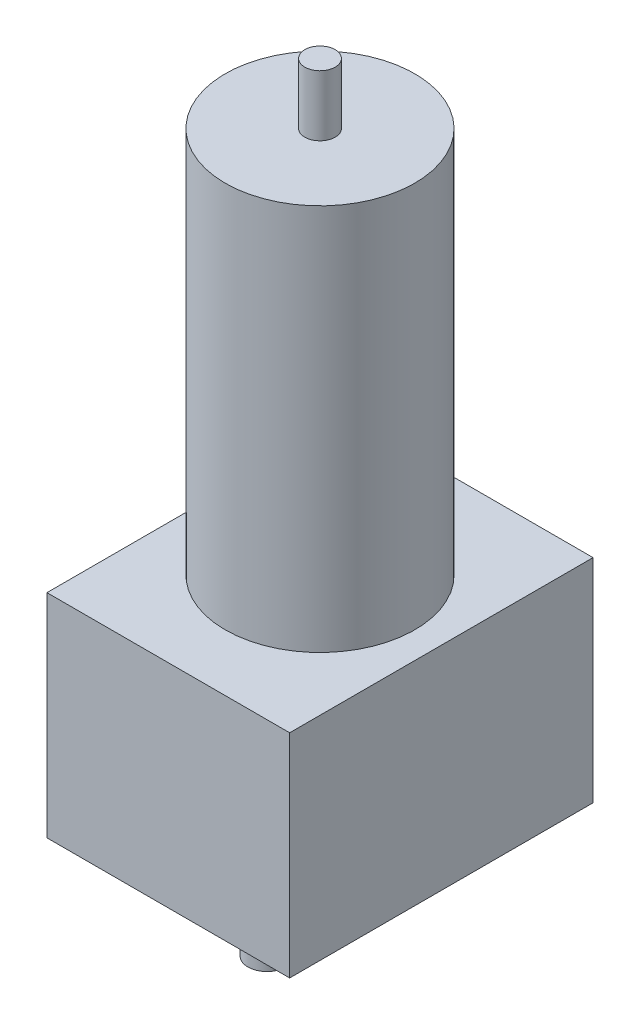
ISO-10303-21;
HEADER;
FILE_DESCRIPTION(('STEP AP214'),'2;1');
FILE_NAME('part.step','',(''),(''),'','','');
FILE_SCHEMA(('AUTOMOTIVE_DESIGN { 1 0 10303 214 1 1 1 1 }'));
ENDSEC;
DATA;
#1=APPLICATION_CONTEXT('core data for automotive mechanical design processes');
#2=APPLICATION_PROTOCOL_DEFINITION('international standard','automotive_design',2000,#1);
#3=PRODUCT_CONTEXT('',#1,'mechanical');
#4=PRODUCT('Part','Part','',(#3));
#5=PRODUCT_RELATED_PRODUCT_CATEGORY('part','',(#4));
#6=PRODUCT_DEFINITION_FORMATION('','',#4);
#7=PRODUCT_DEFINITION_CONTEXT('part definition',#1,'design');
#8=PRODUCT_DEFINITION('design','',#6,#7);
#9=PRODUCT_DEFINITION_SHAPE('','',#8);
#10=(LENGTH_UNIT() NAMED_UNIT(*) SI_UNIT(.MILLI.,.METRE.));
#11=(NAMED_UNIT(*) PLANE_ANGLE_UNIT() SI_UNIT($,.RADIAN.));
#12=(NAMED_UNIT(*) SI_UNIT($,.STERADIAN.) SOLID_ANGLE_UNIT());
#13=UNCERTAINTY_MEASURE_WITH_UNIT(LENGTH_MEASURE(1.E-05),#10,'distance_accuracy_value','');
#14=(GEOMETRIC_REPRESENTATION_CONTEXT(3) GLOBAL_UNCERTAINTY_ASSIGNED_CONTEXT((#13)) GLOBAL_UNIT_ASSIGNED_CONTEXT((#10,
#11,#12)) REPRESENTATION_CONTEXT('',''));
#15=CARTESIAN_POINT('',(0.,0.,0.));
#16=DIRECTION('',(0.,0.,1.));
#17=DIRECTION('',(1.,0.,0.));
#18=AXIS2_PLACEMENT_3D('',#15,#16,#17);
#19=CARTESIAN_POINT('',(0.,0.,0.));
#20=DIRECTION('',(0.,1.,0.));
#21=DIRECTION('',(0.,0.,1.));
#22=AXIS2_PLACEMENT_3D('',#19,#20,#21);
#23=PLANE('',#22);
#24=CARTESIAN_POINT('',(42.8625,0.,-50.1740619184623));
#25=DIRECTION('',(0.,-1.,0.));
#26=DIRECTION('',(0.,0.,-1.));
#27=AXIS2_PLACEMENT_3D('',#24,#25,#26);
#28=CIRCLE('',#27,3.96875);
#29=CARTESIAN_POINT('',(42.8625,0.,-54.1428119184623));
#30=VERTEX_POINT('',#29);
#31=EDGE_CURVE('E266',#30,#30,#28,.T.);
#32=ORIENTED_EDGE('',*,*,#31,.F.);
#33=EDGE_LOOP('',(#32));
#34=FACE_BOUND('',#33,.T.);
#35=CARTESIAN_POINT('',(-42.8625,0.,-50.1740619184623));
#36=DIRECTION('',(0.,-1.,0.));
#37=DIRECTION('',(0.,0.,-1.));
#38=AXIS2_PLACEMENT_3D('',#35,#36,#37);
#39=CIRCLE('',#38,3.96875);
#40=CARTESIAN_POINT('',(-42.8625,0.,-54.1428119184623));
#41=VERTEX_POINT('',#40);
#42=EDGE_CURVE('E265',#41,#41,#39,.T.);
#43=ORIENTED_EDGE('',*,*,#42,.F.);
#44=EDGE_LOOP('',(#43));
#45=FACE_BOUND('',#44,.T.);
#46=CARTESIAN_POINT('',(42.8625,0.,38.1));
#47=DIRECTION('',(0.,-1.,0.));
#48=DIRECTION('',(0.,0.,-1.));
#49=AXIS2_PLACEMENT_3D('',#46,#47,#48);
#50=CIRCLE('',#49,3.96875);
#51=CARTESIAN_POINT('',(42.8625,0.,34.13125));
#52=VERTEX_POINT('',#51);
#53=EDGE_CURVE('E275',#52,#52,#50,.T.);
#54=ORIENTED_EDGE('',*,*,#53,.F.);
#55=EDGE_LOOP('',(#54));
#56=FACE_BOUND('',#55,.T.);
#57=CARTESIAN_POINT('',(-42.8625,0.,38.1));
#58=DIRECTION('',(0.,-1.,0.));
#59=DIRECTION('',(0.,0.,-1.));
#60=AXIS2_PLACEMENT_3D('',#57,#58,#59);
#61=CIRCLE('',#60,3.96875);
#62=CARTESIAN_POINT('',(-42.8625,0.,34.13125));
#63=VERTEX_POINT('',#62);
#64=EDGE_CURVE('E280',#63,#63,#61,.T.);
#65=ORIENTED_EDGE('',*,*,#64,.F.);
#66=EDGE_LOOP('',(#65));
#67=FACE_BOUND('',#66,.T.);
#68=DIRECTION('',(0.,0.,-1.));
#69=VECTOR('',#68,1.);
#70=CARTESIAN_POINT('',(50.8,0.,-63.5));
#71=LINE('',#70,#69);
#72=CARTESIAN_POINT('',(50.8,0.,63.5));
#73=VERTEX_POINT('',#72);
#74=CARTESIAN_POINT('',(50.8,0.,-63.5));
#75=VERTEX_POINT('',#74);
#76=EDGE_CURVE('E101',#73,#75,#71,.T.);
#77=ORIENTED_EDGE('',*,*,#76,.F.);
#78=DIRECTION('',(1.,0.,0.));
#79=VECTOR('',#78,1.);
#80=CARTESIAN_POINT('',(-50.8,0.,63.5));
#81=LINE('',#80,#79);
#82=CARTESIAN_POINT('',(-50.8,0.,63.5));
#83=VERTEX_POINT('',#82);
#84=EDGE_CURVE('E73',#83,#73,#81,.T.);
#85=ORIENTED_EDGE('',*,*,#84,.F.);
#86=DIRECTION('',(0.,0.,1.));
#87=VECTOR('',#86,1.);
#88=CARTESIAN_POINT('',(-50.8,0.,-63.5));
#89=LINE('',#88,#87);
#90=CARTESIAN_POINT('',(-50.8,0.,-63.5));
#91=VERTEX_POINT('',#90);
#92=EDGE_CURVE('E67',#91,#83,#89,.T.);
#93=ORIENTED_EDGE('',*,*,#92,.F.);
#94=DIRECTION('',(-1.,0.,0.));
#95=VECTOR('',#94,1.);
#96=CARTESIAN_POINT('',(-50.8,0.,-63.5));
#97=LINE('',#96,#95);
#98=EDGE_CURVE('E92',#75,#91,#97,.T.);
#99=ORIENTED_EDGE('',*,*,#98,.F.);
#100=EDGE_LOOP('',(#77,#85,#93,#99));
#101=FACE_BOUND('',#100,.T.);
#102=CARTESIAN_POINT('',(0.,0.,22.225));
#103=DIRECTION('',(0.,1.,0.));
#104=DIRECTION('',(0.,0.,1.));
#105=AXIS2_PLACEMENT_3D('',#102,#103,#104);
#106=CIRCLE('',#105,7.9375);
#107=CARTESIAN_POINT('',(0.,0.,30.1625));
#108=VERTEX_POINT('',#107);
#109=EDGE_CURVE('E11',#108,#108,#106,.F.);
#110=ORIENTED_EDGE('',*,*,#109,.F.);
#111=EDGE_LOOP('',(#110));
#112=FACE_BOUND('',#111,.T.);
#113=ADVANCED_FACE('F33',(#34,#45,#56,#67,#101,#112),#23,.F.);
#114=CARTESIAN_POINT('',(0.,250.825,0.));
#115=DIRECTION('',(0.,1.,0.));
#116=DIRECTION('',(0.,0.,1.));
#117=AXIS2_PLACEMENT_3D('',#114,#115,#116);
#118=PLANE('',#117);
#119=CARTESIAN_POINT('',(0.,250.825,0.));
#120=DIRECTION('',(0.,1.,0.));
#121=DIRECTION('',(0.,0.,1.));
#122=AXIS2_PLACEMENT_3D('',#119,#120,#121);
#123=CIRCLE('',#122,39.6875);
#124=CARTESIAN_POINT('',(0.,250.825,39.6875));
#125=VERTEX_POINT('',#124);
#126=EDGE_CURVE('E104',#125,#125,#123,.T.);
#127=ORIENTED_EDGE('',*,*,#126,.T.);
#128=EDGE_LOOP('',(#127));
#129=FACE_BOUND('',#128,.T.);
#130=CARTESIAN_POINT('',(0.,250.825,0.));
#131=DIRECTION('',(0.,1.,0.));
#132=DIRECTION('',(0.,0.,1.));
#133=AXIS2_PLACEMENT_3D('',#130,#131,#132);
#134=CIRCLE('',#133,6.35);
#135=CARTESIAN_POINT('',(0.,250.825,6.35));
#136=VERTEX_POINT('',#135);
#137=EDGE_CURVE('E291',#136,#136,#134,.T.);
#138=ORIENTED_EDGE('',*,*,#137,.F.);
#139=EDGE_LOOP('',(#138));
#140=FACE_BOUND('',#139,.T.);
#141=ADVANCED_FACE('F114',(#129,#140),#118,.T.);
#142=CARTESIAN_POINT('',(0.,88.9,0.));
#143=DIRECTION('',(0.,1.,0.));
#144=DIRECTION('',(0.,0.,1.));
#145=AXIS2_PLACEMENT_3D('',#142,#143,#144);
#146=PLANE('',#145);
#147=DIRECTION('',(0.,0.,-1.));
#148=VECTOR('',#147,1.);
#149=CARTESIAN_POINT('',(50.8,88.9,-63.5));
#150=LINE('',#149,#148);
#151=CARTESIAN_POINT('',(50.8,88.9,63.5));
#152=VERTEX_POINT('',#151);
#153=CARTESIAN_POINT('',(50.8,88.9,-63.5));
#154=VERTEX_POINT('',#153);
#155=EDGE_CURVE('E87',#152,#154,#150,.T.);
#156=ORIENTED_EDGE('',*,*,#155,.T.);
#157=DIRECTION('',(-1.,0.,0.));
#158=VECTOR('',#157,1.);
#159=CARTESIAN_POINT('',(-50.8,88.9,-63.5));
#160=LINE('',#159,#158);
#161=CARTESIAN_POINT('',(-50.8,88.9,-63.5));
#162=VERTEX_POINT('',#161);
#163=EDGE_CURVE('E81',#154,#162,#160,.T.);
#164=ORIENTED_EDGE('',*,*,#163,.T.);
#165=DIRECTION('',(0.,0.,1.));
#166=VECTOR('',#165,1.);
#167=CARTESIAN_POINT('',(-50.8,88.9,-63.5));
#168=LINE('',#167,#166);
#169=CARTESIAN_POINT('',(-50.8,88.9,63.5));
#170=VERTEX_POINT('',#169);
#171=EDGE_CURVE('E85',#162,#170,#168,.T.);
#172=ORIENTED_EDGE('',*,*,#171,.T.);
#173=DIRECTION('',(1.,0.,0.));
#174=VECTOR('',#173,1.);
#175=CARTESIAN_POINT('',(-50.8,88.9,63.5));
#176=LINE('',#175,#174);
#177=EDGE_CURVE('E50',#170,#152,#176,.T.);
#178=ORIENTED_EDGE('',*,*,#177,.T.);
#179=EDGE_LOOP('',(#156,#164,#172,#178));
#180=FACE_BOUND('',#179,.T.);
#181=CARTESIAN_POINT('',(0.,88.9,0.));
#182=DIRECTION('',(0.,1.,0.));
#183=DIRECTION('',(0.,0.,1.));
#184=AXIS2_PLACEMENT_3D('',#181,#182,#183);
#185=CIRCLE('',#184,39.6875);
#186=CARTESIAN_POINT('',(0.,88.9,39.6875));
#187=VERTEX_POINT('',#186);
#188=EDGE_CURVE('E295',#187,#187,#185,.T.);
#189=ORIENTED_EDGE('',*,*,#188,.F.);
#190=EDGE_LOOP('',(#189));
#191=FACE_BOUND('',#190,.T.);
#192=ADVANCED_FACE('F82',(#180,#191),#146,.T.);
#193=CARTESIAN_POINT('',(50.8,88.9,-63.5));
#194=DIRECTION('',(-1.,0.,0.));
#195=DIRECTION('',(0.,0.,1.));
#196=AXIS2_PLACEMENT_3D('',#193,#194,#195);
#197=PLANE('',#196);
#198=ORIENTED_EDGE('',*,*,#76,.T.);
#199=DIRECTION('',(0.,-1.,0.));
#200=VECTOR('',#199,1.);
#201=CARTESIAN_POINT('',(50.8,88.9,-63.5));
#202=LINE('',#201,#200);
#203=EDGE_CURVE('E42',#154,#75,#202,.T.);
#204=ORIENTED_EDGE('',*,*,#203,.F.);
#205=ORIENTED_EDGE('',*,*,#155,.F.);
#206=DIRECTION('',(0.,-1.,0.));
#207=VECTOR('',#206,1.);
#208=CARTESIAN_POINT('',(50.8,88.9,63.5));
#209=LINE('',#208,#207);
#210=EDGE_CURVE('E97',#152,#73,#209,.T.);
#211=ORIENTED_EDGE('',*,*,#210,.T.);
#212=EDGE_LOOP('',(#198,#204,#205,#211));
#213=FACE_BOUND('',#212,.T.);
#214=ADVANCED_FACE('F35',(#213),#197,.F.);
#215=CARTESIAN_POINT('',(-50.8,88.9,-63.5));
#216=DIRECTION('',(0.,0.,1.));
#217=DIRECTION('',(1.,0.,0.));
#218=AXIS2_PLACEMENT_3D('',#215,#216,#217);
#219=PLANE('',#218);
#220=ORIENTED_EDGE('',*,*,#98,.T.);
#221=DIRECTION('',(0.,-1.,0.));
#222=VECTOR('',#221,1.);
#223=CARTESIAN_POINT('',(-50.8,88.9,-63.5));
#224=LINE('',#223,#222);
#225=EDGE_CURVE('E90',#162,#91,#224,.T.);
#226=ORIENTED_EDGE('',*,*,#225,.F.);
#227=ORIENTED_EDGE('',*,*,#163,.F.);
#228=ORIENTED_EDGE('',*,*,#203,.T.);
#229=EDGE_LOOP('',(#220,#226,#227,#228));
#230=FACE_BOUND('',#229,.T.);
#231=ADVANCED_FACE('F91',(#230),#219,.F.);
#232=CARTESIAN_POINT('',(-50.8,88.9,-63.5));
#233=DIRECTION('',(1.,0.,0.));
#234=DIRECTION('',(0.,0.,-1.));
#235=AXIS2_PLACEMENT_3D('',#232,#233,#234);
#236=PLANE('',#235);
#237=ORIENTED_EDGE('',*,*,#92,.T.);
#238=DIRECTION('',(0.,-1.,0.));
#239=VECTOR('',#238,1.);
#240=CARTESIAN_POINT('',(-50.8,88.9,63.5));
#241=LINE('',#240,#239);
#242=EDGE_CURVE('E93',#170,#83,#241,.T.);
#243=ORIENTED_EDGE('',*,*,#242,.F.);
#244=ORIENTED_EDGE('',*,*,#171,.F.);
#245=ORIENTED_EDGE('',*,*,#225,.T.);
#246=EDGE_LOOP('',(#237,#243,#244,#245));
#247=FACE_BOUND('',#246,.T.);
#248=ADVANCED_FACE('F95',(#247),#236,.F.);
#249=CARTESIAN_POINT('',(-50.8,88.9,63.5));
#250=DIRECTION('',(0.,0.,-1.));
#251=DIRECTION('',(-1.,0.,0.));
#252=AXIS2_PLACEMENT_3D('',#249,#250,#251);
#253=PLANE('',#252);
#254=ORIENTED_EDGE('',*,*,#84,.T.);
#255=ORIENTED_EDGE('',*,*,#210,.F.);
#256=ORIENTED_EDGE('',*,*,#177,.F.);
#257=ORIENTED_EDGE('',*,*,#242,.T.);
#258=EDGE_LOOP('',(#254,#255,#256,#257));
#259=FACE_BOUND('',#258,.T.);
#260=ADVANCED_FACE('F147',(#259),#253,.F.);
#261=CARTESIAN_POINT('',(0.,250.825,0.));
#262=DIRECTION('',(0.,-1.,0.));
#263=DIRECTION('',(0.,0.,-1.));
#264=AXIS2_PLACEMENT_3D('',#261,#262,#263);
#265=CYLINDRICAL_SURFACE('',#264,39.6875);
#266=ORIENTED_EDGE('',*,*,#126,.F.);
#267=EDGE_LOOP('',(#266));
#268=FACE_BOUND('',#267,.T.);
#269=ORIENTED_EDGE('',*,*,#188,.T.);
#270=EDGE_LOOP('',(#269));
#271=FACE_BOUND('',#270,.T.);
#272=ADVANCED_FACE('F140',(#268,#271),#265,.T.);
#273=CARTESIAN_POINT('',(0.,276.225,0.));
#274=DIRECTION('',(0.,-1.,0.));
#275=DIRECTION('',(0.,0.,-1.));
#276=AXIS2_PLACEMENT_3D('',#273,#274,#275);
#277=CYLINDRICAL_SURFACE('',#276,6.35);
#278=CARTESIAN_POINT('',(0.,276.225,0.));
#279=DIRECTION('',(0.,1.,0.));
#280=DIRECTION('',(0.,0.,1.));
#281=AXIS2_PLACEMENT_3D('',#278,#279,#280);
#282=CIRCLE('',#281,6.35);
#283=CARTESIAN_POINT('',(0.,276.225,6.35));
#284=VERTEX_POINT('',#283);
#285=EDGE_CURVE('E292',#284,#284,#282,.T.);
#286=ORIENTED_EDGE('',*,*,#285,.F.);
#287=EDGE_LOOP('',(#286));
#288=FACE_BOUND('',#287,.T.);
#289=ORIENTED_EDGE('',*,*,#137,.T.);
#290=EDGE_LOOP('',(#289));
#291=FACE_BOUND('',#290,.T.);
#292=ADVANCED_FACE('F132',(#288,#291),#277,.T.);
#293=CARTESIAN_POINT('',(0.,276.225,0.));
#294=DIRECTION('',(0.,1.,0.));
#295=DIRECTION('',(0.,0.,1.));
#296=AXIS2_PLACEMENT_3D('',#293,#294,#295);
#297=PLANE('',#296);
#298=ORIENTED_EDGE('',*,*,#285,.T.);
#299=EDGE_LOOP('',(#298));
#300=FACE_BOUND('',#299,.T.);
#301=ADVANCED_FACE('F122',(#300),#297,.T.);
#302=CARTESIAN_POINT('',(0.,-38.1,22.225));
#303=DIRECTION('',(0.,1.,0.));
#304=DIRECTION('',(0.,0.,1.));
#305=AXIS2_PLACEMENT_3D('',#302,#303,#304);
#306=CYLINDRICAL_SURFACE('',#305,7.9375);
#307=CARTESIAN_POINT('',(0.,-38.1,22.225));
#308=DIRECTION('',(0.,-1.,0.));
#309=DIRECTION('',(0.,0.,-1.));
#310=AXIS2_PLACEMENT_3D('',#307,#308,#309);
#311=CIRCLE('',#310,7.9375);
#312=CARTESIAN_POINT('',(0.,-38.1,14.2875));
#313=VERTEX_POINT('',#312);
#314=EDGE_CURVE('E286',#313,#313,#311,.T.);
#315=ORIENTED_EDGE('',*,*,#314,.F.);
#316=EDGE_LOOP('',(#315));
#317=FACE_BOUND('',#316,.T.);
#318=ORIENTED_EDGE('',*,*,#109,.T.);
#319=EDGE_LOOP('',(#318));
#320=FACE_BOUND('',#319,.T.);
#321=ADVANCED_FACE('F119',(#317,#320),#306,.T.);
#322=CARTESIAN_POINT('',(0.,-38.1,22.225));
#323=DIRECTION('',(0.,-1.,0.));
#324=DIRECTION('',(0.,0.,-1.));
#325=AXIS2_PLACEMENT_3D('',#322,#323,#324);
#326=PLANE('',#325);
#327=ORIENTED_EDGE('',*,*,#314,.T.);
#328=EDGE_LOOP('',(#327));
#329=FACE_BOUND('',#328,.T.);
#330=ADVANCED_FACE('F121',(#329),#326,.T.);
#331=CARTESIAN_POINT('',(-42.8625,25.4,38.1));
#332=DIRECTION('',(0.,-1.,0.));
#333=DIRECTION('',(0.,0.,-1.));
#334=AXIS2_PLACEMENT_3D('',#331,#332,#333);
#335=CYLINDRICAL_SURFACE('',#334,3.96875);
#336=CARTESIAN_POINT('',(-42.8625,25.4,38.1));
#337=DIRECTION('',(0.,-1.,0.));
#338=DIRECTION('',(0.,0.,-1.));
#339=AXIS2_PLACEMENT_3D('',#336,#337,#338);
#340=CIRCLE('',#339,3.96875);
#341=CARTESIAN_POINT('',(-42.8625,25.4,34.13125));
#342=VERTEX_POINT('',#341);
#343=EDGE_CURVE('E283',#342,#342,#340,.T.);
#344=ORIENTED_EDGE('',*,*,#343,.F.);
#345=EDGE_LOOP('',(#344));
#346=FACE_BOUND('',#345,.T.);
#347=ORIENTED_EDGE('',*,*,#64,.T.);
#348=EDGE_LOOP('',(#347));
#349=FACE_BOUND('',#348,.T.);
#350=ADVANCED_FACE('F129',(#346,#349),#335,.F.);
#351=CARTESIAN_POINT('',(-42.8625,25.4,38.1));
#352=DIRECTION('',(0.,-1.,0.));
#353=DIRECTION('',(0.,0.,-1.));
#354=AXIS2_PLACEMENT_3D('',#351,#352,#353);
#355=PLANE('',#354);
#356=ORIENTED_EDGE('',*,*,#343,.T.);
#357=EDGE_LOOP('',(#356));
#358=FACE_BOUND('',#357,.T.);
#359=ADVANCED_FACE('F189',(#358),#355,.T.);
#360=CARTESIAN_POINT('',(42.8625,25.4,38.1));
#361=DIRECTION('',(0.,-1.,0.));
#362=DIRECTION('',(0.,0.,-1.));
#363=AXIS2_PLACEMENT_3D('',#360,#361,#362);
#364=CYLINDRICAL_SURFACE('',#363,3.96875);
#365=CARTESIAN_POINT('',(42.8625,25.4,38.1));
#366=DIRECTION('',(0.,-1.,0.));
#367=DIRECTION('',(0.,0.,-1.));
#368=AXIS2_PLACEMENT_3D('',#365,#366,#367);
#369=CIRCLE('',#368,3.96875);
#370=CARTESIAN_POINT('',(42.8625,25.4,34.13125));
#371=VERTEX_POINT('',#370);
#372=EDGE_CURVE('E277',#371,#371,#369,.T.);
#373=ORIENTED_EDGE('',*,*,#372,.F.);
#374=EDGE_LOOP('',(#373));
#375=FACE_BOUND('',#374,.T.);
#376=ORIENTED_EDGE('',*,*,#53,.T.);
#377=EDGE_LOOP('',(#376));
#378=FACE_BOUND('',#377,.T.);
#379=ADVANCED_FACE('F198',(#375,#378),#364,.F.);
#380=CARTESIAN_POINT('',(42.8625,25.4,38.1));
#381=DIRECTION('',(0.,-1.,0.));
#382=DIRECTION('',(0.,0.,-1.));
#383=AXIS2_PLACEMENT_3D('',#380,#381,#382);
#384=PLANE('',#383);
#385=ORIENTED_EDGE('',*,*,#372,.T.);
#386=EDGE_LOOP('',(#385));
#387=FACE_BOUND('',#386,.T.);
#388=ADVANCED_FACE('F208',(#387),#384,.T.);
#389=CARTESIAN_POINT('',(-42.8625,25.4,-50.1740619184623));
#390=DIRECTION('',(0.,-1.,0.));
#391=DIRECTION('',(0.,0.,-1.));
#392=AXIS2_PLACEMENT_3D('',#389,#390,#391);
#393=CYLINDRICAL_SURFACE('',#392,3.96875);
#394=CARTESIAN_POINT('',(-42.8625,25.4,-50.1740619184623));
#395=DIRECTION('',(0.,-1.,0.));
#396=DIRECTION('',(0.,0.,-1.));
#397=AXIS2_PLACEMENT_3D('',#394,#395,#396);
#398=CIRCLE('',#397,3.96875);
#399=CARTESIAN_POINT('',(-42.8625,25.4,-54.1428119184623));
#400=VERTEX_POINT('',#399);
#401=EDGE_CURVE('E269',#400,#400,#398,.T.);
#402=ORIENTED_EDGE('',*,*,#401,.F.);
#403=EDGE_LOOP('',(#402));
#404=FACE_BOUND('',#403,.T.);
#405=ORIENTED_EDGE('',*,*,#42,.T.);
#406=EDGE_LOOP('',(#405));
#407=FACE_BOUND('',#406,.T.);
#408=ADVANCED_FACE('F218',(#404,#407),#393,.F.);
#409=CARTESIAN_POINT('',(-42.8625,25.4,-50.1740619184623));
#410=DIRECTION('',(0.,-1.,0.));
#411=DIRECTION('',(0.,0.,-1.));
#412=AXIS2_PLACEMENT_3D('',#409,#410,#411);
#413=PLANE('',#412);
#414=ORIENTED_EDGE('',*,*,#401,.T.);
#415=EDGE_LOOP('',(#414));
#416=FACE_BOUND('',#415,.T.);
#417=ADVANCED_FACE('F228',(#416),#413,.T.);
#418=CARTESIAN_POINT('',(42.8625,25.4,-50.1740619184623));
#419=DIRECTION('',(0.,-1.,0.));
#420=DIRECTION('',(0.,0.,-1.));
#421=AXIS2_PLACEMENT_3D('',#418,#419,#420);
#422=CYLINDRICAL_SURFACE('',#421,3.96875);
#423=CARTESIAN_POINT('',(42.8625,25.4,-50.1740619184623));
#424=DIRECTION('',(0.,-1.,0.));
#425=DIRECTION('',(0.,0.,-1.));
#426=AXIS2_PLACEMENT_3D('',#423,#424,#425);
#427=CIRCLE('',#426,3.96875);
#428=CARTESIAN_POINT('',(42.8625,25.4,-54.1428119184623));
#429=VERTEX_POINT('',#428);
#430=EDGE_CURVE('E264',#429,#429,#427,.T.);
#431=ORIENTED_EDGE('',*,*,#430,.F.);
#432=EDGE_LOOP('',(#431));
#433=FACE_BOUND('',#432,.T.);
#434=ORIENTED_EDGE('',*,*,#31,.T.);
#435=EDGE_LOOP('',(#434));
#436=FACE_BOUND('',#435,.T.);
#437=ADVANCED_FACE('F238',(#433,#436),#422,.F.);
#438=CARTESIAN_POINT('',(42.8625,25.4,-50.1740619184623));
#439=DIRECTION('',(0.,-1.,0.));
#440=DIRECTION('',(0.,0.,-1.));
#441=AXIS2_PLACEMENT_3D('',#438,#439,#440);
#442=PLANE('',#441);
#443=ORIENTED_EDGE('',*,*,#430,.T.);
#444=EDGE_LOOP('',(#443));
#445=FACE_BOUND('',#444,.T.);
#446=ADVANCED_FACE('F248',(#445),#442,.T.);
#447=CLOSED_SHELL('',(#113,#141,#192,#214,#231,#248,#260,#272,#292,#301,#321,#330,#350,#359,
#379,#388,#408,#417,#437,#446));
#448=MANIFOLD_SOLID_BREP('B2',#447);
#449=ADVANCED_BREP_SHAPE_REPRESENTATION('',(#18,#448),#14);
#450=SHAPE_DEFINITION_REPRESENTATION(#9,#449);
ENDSEC;
END-ISO-10303-21;
